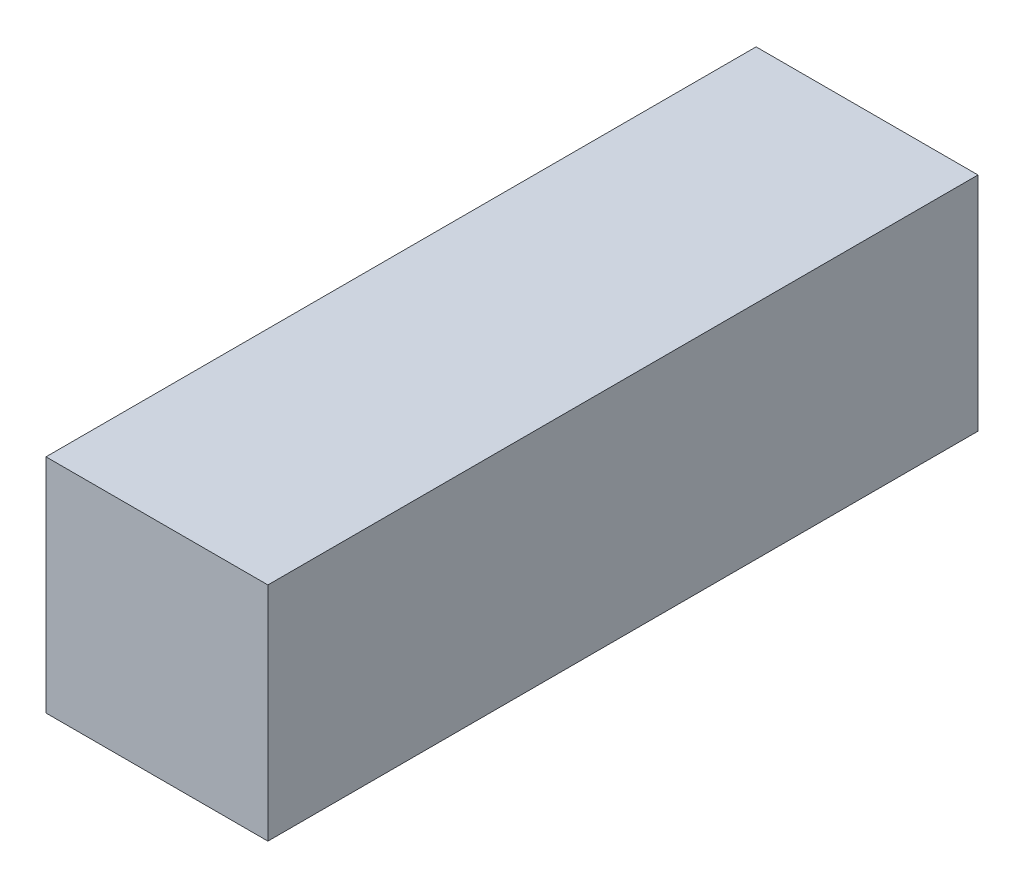
ISO-10303-21;
HEADER;
FILE_DESCRIPTION(('STEP AP214'),'2;1');
FILE_NAME('part.step','',(''),(''),'','','');
FILE_SCHEMA(('AUTOMOTIVE_DESIGN { 1 0 10303 214 1 1 1 1 }'));
ENDSEC;
DATA;
#1=APPLICATION_CONTEXT('core data for automotive mechanical design processes');
#2=APPLICATION_PROTOCOL_DEFINITION('international standard','automotive_design',2000,#1);
#3=PRODUCT_CONTEXT('',#1,'mechanical');
#4=PRODUCT('Part','Part','',(#3));
#5=PRODUCT_RELATED_PRODUCT_CATEGORY('part','',(#4));
#6=PRODUCT_DEFINITION_FORMATION('','',#4);
#7=PRODUCT_DEFINITION_CONTEXT('part definition',#1,'design');
#8=PRODUCT_DEFINITION('design','',#6,#7);
#9=PRODUCT_DEFINITION_SHAPE('','',#8);
#10=(LENGTH_UNIT() NAMED_UNIT(*) SI_UNIT(.MILLI.,.METRE.));
#11=(NAMED_UNIT(*) PLANE_ANGLE_UNIT() SI_UNIT($,.RADIAN.));
#12=(NAMED_UNIT(*) SI_UNIT($,.STERADIAN.) SOLID_ANGLE_UNIT());
#13=UNCERTAINTY_MEASURE_WITH_UNIT(LENGTH_MEASURE(1.E-05),#10,'distance_accuracy_value','');
#14=(GEOMETRIC_REPRESENTATION_CONTEXT(3) GLOBAL_UNCERTAINTY_ASSIGNED_CONTEXT((#13)) GLOBAL_UNIT_ASSIGNED_CONTEXT((#10,
#11,#12)) REPRESENTATION_CONTEXT('',''));
#15=CARTESIAN_POINT('',(0.,0.,0.));
#16=DIRECTION('',(0.,0.,1.));
#17=DIRECTION('',(1.,0.,0.));
#18=AXIS2_PLACEMENT_3D('',#15,#16,#17);
#19=CARTESIAN_POINT('',(17.5,-17.5,112.));
#20=DIRECTION('',(-1.,0.,0.));
#21=DIRECTION('',(0.,0.,1.));
#22=AXIS2_PLACEMENT_3D('',#19,#20,#21);
#23=PLANE('',#22);
#24=DIRECTION('',(0.,1.,0.));
#25=VECTOR('',#24,1.);
#26=CARTESIAN_POINT('',(17.5,-17.5,0.));
#27=LINE('',#26,#25);
#28=CARTESIAN_POINT('',(17.5,-17.5,0.));
#29=VERTEX_POINT('',#28);
#30=CARTESIAN_POINT('',(17.5,17.5,0.));
#31=VERTEX_POINT('',#30);
#32=EDGE_CURVE('E96',#29,#31,#27,.T.);
#33=ORIENTED_EDGE('',*,*,#32,.T.);
#34=DIRECTION('',(0.,0.,-1.));
#35=VECTOR('',#34,1.);
#36=CARTESIAN_POINT('',(17.5,17.5,112.));
#37=LINE('',#36,#35);
#38=CARTESIAN_POINT('',(17.5,17.5,112.));
#39=VERTEX_POINT('',#38);
#40=EDGE_CURVE('E11',#39,#31,#37,.T.);
#41=ORIENTED_EDGE('',*,*,#40,.F.);
#42=DIRECTION('',(0.,1.,0.));
#43=VECTOR('',#42,1.);
#44=CARTESIAN_POINT('',(17.5,-17.5,112.));
#45=LINE('',#44,#43);
#46=CARTESIAN_POINT('',(17.5,-17.5,112.));
#47=VERTEX_POINT('',#46);
#48=EDGE_CURVE('E84',#47,#39,#45,.T.);
#49=ORIENTED_EDGE('',*,*,#48,.F.);
#50=DIRECTION('',(0.,0.,-1.));
#51=VECTOR('',#50,1.);
#52=CARTESIAN_POINT('',(17.5,-17.5,112.));
#53=LINE('',#52,#51);
#54=EDGE_CURVE('E92',#47,#29,#53,.T.);
#55=ORIENTED_EDGE('',*,*,#54,.T.);
#56=EDGE_LOOP('',(#33,#41,#49,#55));
#57=FACE_BOUND('',#56,.T.);
#58=ADVANCED_FACE('F33',(#57),#23,.F.);
#59=CARTESIAN_POINT('',(-17.5,17.5,112.));
#60=DIRECTION('',(0.,-1.,0.));
#61=DIRECTION('',(0.,0.,-1.));
#62=AXIS2_PLACEMENT_3D('',#59,#60,#61);
#63=PLANE('',#62);
#64=DIRECTION('',(-1.,0.,0.));
#65=VECTOR('',#64,1.);
#66=CARTESIAN_POINT('',(-17.5,17.5,0.));
#67=LINE('',#66,#65);
#68=CARTESIAN_POINT('',(-17.5,17.5,0.));
#69=VERTEX_POINT('',#68);
#70=EDGE_CURVE('E88',#31,#69,#67,.T.);
#71=ORIENTED_EDGE('',*,*,#70,.T.);
#72=DIRECTION('',(0.,0.,-1.));
#73=VECTOR('',#72,1.);
#74=CARTESIAN_POINT('',(-17.5,17.5,112.));
#75=LINE('',#74,#73);
#76=CARTESIAN_POINT('',(-17.5,17.5,112.));
#77=VERTEX_POINT('',#76);
#78=EDGE_CURVE('E41',#77,#69,#75,.T.);
#79=ORIENTED_EDGE('',*,*,#78,.F.);
#80=DIRECTION('',(-1.,0.,0.));
#81=VECTOR('',#80,1.);
#82=CARTESIAN_POINT('',(-17.5,17.5,112.));
#83=LINE('',#82,#81);
#84=EDGE_CURVE('E79',#39,#77,#83,.T.);
#85=ORIENTED_EDGE('',*,*,#84,.F.);
#86=ORIENTED_EDGE('',*,*,#40,.T.);
#87=EDGE_LOOP('',(#71,#79,#85,#86));
#88=FACE_BOUND('',#87,.T.);
#89=ADVANCED_FACE('F87',(#88),#63,.F.);
#90=CARTESIAN_POINT('',(-17.5,-17.5,112.));
#91=DIRECTION('',(1.,0.,0.));
#92=DIRECTION('',(0.,0.,-1.));
#93=AXIS2_PLACEMENT_3D('',#90,#91,#92);
#94=PLANE('',#93);
#95=DIRECTION('',(0.,-1.,0.));
#96=VECTOR('',#95,1.);
#97=CARTESIAN_POINT('',(-17.5,-17.5,0.));
#98=LINE('',#97,#96);
#99=CARTESIAN_POINT('',(-17.5,-17.5,0.));
#100=VERTEX_POINT('',#99);
#101=EDGE_CURVE('E66',#69,#100,#98,.T.);
#102=ORIENTED_EDGE('',*,*,#101,.T.);
#103=DIRECTION('',(0.,0.,-1.));
#104=VECTOR('',#103,1.);
#105=CARTESIAN_POINT('',(-17.5,-17.5,112.));
#106=LINE('',#105,#104);
#107=CARTESIAN_POINT('',(-17.5,-17.5,112.));
#108=VERTEX_POINT('',#107);
#109=EDGE_CURVE('E89',#108,#100,#106,.T.);
#110=ORIENTED_EDGE('',*,*,#109,.F.);
#111=DIRECTION('',(0.,-1.,0.));
#112=VECTOR('',#111,1.);
#113=CARTESIAN_POINT('',(-17.5,-17.5,112.));
#114=LINE('',#113,#112);
#115=EDGE_CURVE('E82',#77,#108,#114,.T.);
#116=ORIENTED_EDGE('',*,*,#115,.F.);
#117=ORIENTED_EDGE('',*,*,#78,.T.);
#118=EDGE_LOOP('',(#102,#110,#116,#117));
#119=FACE_BOUND('',#118,.T.);
#120=ADVANCED_FACE('F90',(#119),#94,.F.);
#121=CARTESIAN_POINT('',(-17.5,-17.5,112.));
#122=DIRECTION('',(0.,1.,0.));
#123=DIRECTION('',(0.,0.,1.));
#124=AXIS2_PLACEMENT_3D('',#121,#122,#123);
#125=PLANE('',#124);
#126=DIRECTION('',(1.,0.,0.));
#127=VECTOR('',#126,1.);
#128=CARTESIAN_POINT('',(-17.5,-17.5,0.));
#129=LINE('',#128,#127);
#130=EDGE_CURVE('E72',#100,#29,#129,.T.);
#131=ORIENTED_EDGE('',*,*,#130,.T.);
#132=ORIENTED_EDGE('',*,*,#54,.F.);
#133=DIRECTION('',(1.,0.,0.));
#134=VECTOR('',#133,1.);
#135=CARTESIAN_POINT('',(-17.5,-17.5,112.));
#136=LINE('',#135,#134);
#137=EDGE_CURVE('E49',#108,#47,#136,.T.);
#138=ORIENTED_EDGE('',*,*,#137,.F.);
#139=ORIENTED_EDGE('',*,*,#109,.T.);
#140=EDGE_LOOP('',(#131,#132,#138,#139));
#141=FACE_BOUND('',#140,.T.);
#142=ADVANCED_FACE('F103',(#141),#125,.F.);
#143=CARTESIAN_POINT('',(0.,0.,112.));
#144=DIRECTION('',(0.,0.,-1.));
#145=DIRECTION('',(-1.,0.,0.));
#146=AXIS2_PLACEMENT_3D('',#143,#144,#145);
#147=PLANE('',#146);
#148=ORIENTED_EDGE('',*,*,#48,.T.);
#149=ORIENTED_EDGE('',*,*,#84,.T.);
#150=ORIENTED_EDGE('',*,*,#115,.T.);
#151=ORIENTED_EDGE('',*,*,#137,.T.);
#152=EDGE_LOOP('',(#148,#149,#150,#151));
#153=FACE_BOUND('',#152,.T.);
#154=ADVANCED_FACE('F80',(#153),#147,.F.);
#155=CARTESIAN_POINT('',(0.,0.,0.));
#156=DIRECTION('',(0.,0.,-1.));
#157=DIRECTION('',(-1.,0.,0.));
#158=AXIS2_PLACEMENT_3D('',#155,#156,#157);
#159=PLANE('',#158);
#160=ORIENTED_EDGE('',*,*,#32,.F.);
#161=ORIENTED_EDGE('',*,*,#130,.F.);
#162=ORIENTED_EDGE('',*,*,#101,.F.);
#163=ORIENTED_EDGE('',*,*,#70,.F.);
#164=EDGE_LOOP('',(#160,#161,#162,#163));
#165=FACE_BOUND('',#164,.T.);
#166=ADVANCED_FACE('F106',(#165),#159,.T.);
#167=CLOSED_SHELL('',(#58,#89,#120,#142,#154,#166));
#168=MANIFOLD_SOLID_BREP('B2',#167);
#169=ADVANCED_BREP_SHAPE_REPRESENTATION('',(#18,#168),#14);
#170=SHAPE_DEFINITION_REPRESENTATION(#9,#169);
ENDSEC;
END-ISO-10303-21;
